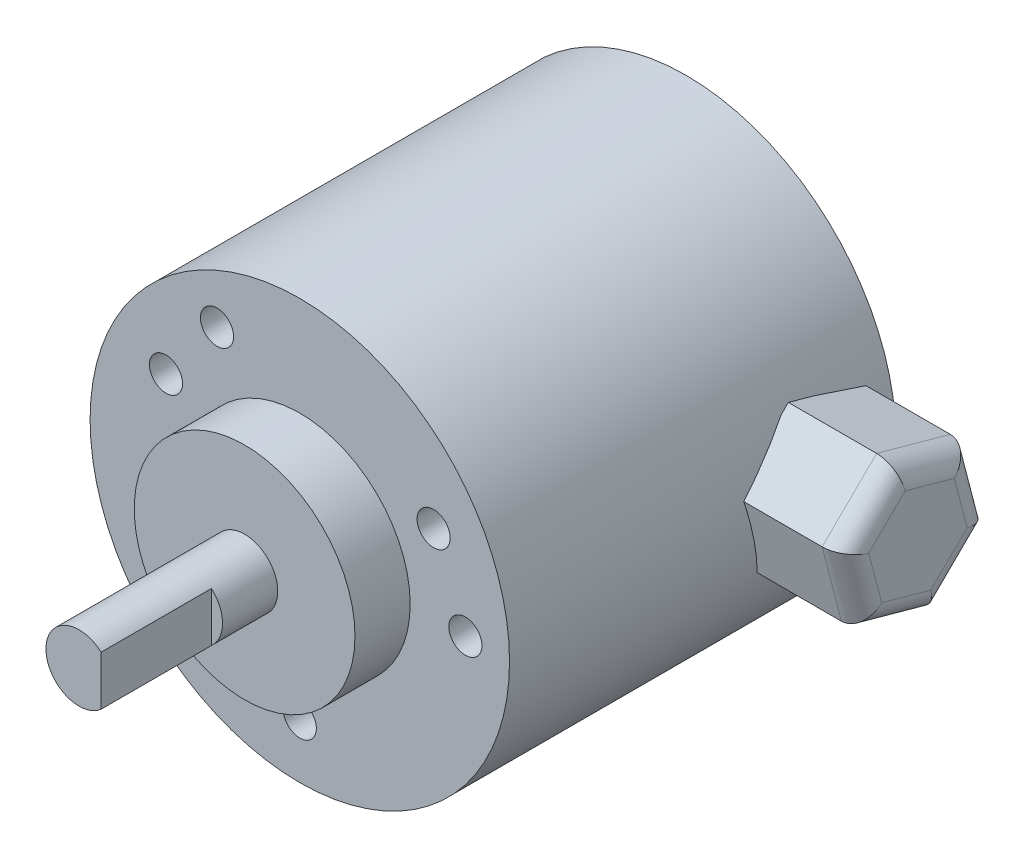
ISO-10303-21;
HEADER;
FILE_DESCRIPTION(('STEP AP214'),'2;1');
FILE_NAME('part.step','',(''),(''),'','','');
FILE_SCHEMA(('AUTOMOTIVE_DESIGN { 1 0 10303 214 1 1 1 1 }'));
ENDSEC;
DATA;
#1=APPLICATION_CONTEXT('core data for automotive mechanical design processes');
#2=APPLICATION_PROTOCOL_DEFINITION('international standard','automotive_design',2000,#1);
#3=PRODUCT_CONTEXT('',#1,'mechanical');
#4=PRODUCT('Part','Part','',(#3));
#5=PRODUCT_RELATED_PRODUCT_CATEGORY('part','',(#4));
#6=PRODUCT_DEFINITION_FORMATION('','',#4);
#7=PRODUCT_DEFINITION_CONTEXT('part definition',#1,'design');
#8=PRODUCT_DEFINITION('design','',#6,#7);
#9=PRODUCT_DEFINITION_SHAPE('','',#8);
#10=(LENGTH_UNIT() NAMED_UNIT(*) SI_UNIT(.MILLI.,.METRE.));
#11=(NAMED_UNIT(*) PLANE_ANGLE_UNIT() SI_UNIT($,.RADIAN.));
#12=(NAMED_UNIT(*) SI_UNIT($,.STERADIAN.) SOLID_ANGLE_UNIT());
#13=UNCERTAINTY_MEASURE_WITH_UNIT(LENGTH_MEASURE(1.E-05),#10,'distance_accuracy_value','');
#14=(GEOMETRIC_REPRESENTATION_CONTEXT(3) GLOBAL_UNCERTAINTY_ASSIGNED_CONTEXT((#13)) GLOBAL_UNIT_ASSIGNED_CONTEXT((#10,
#11,#12)) REPRESENTATION_CONTEXT('',''));
#15=CARTESIAN_POINT('',(0.,0.,0.));
#16=DIRECTION('',(0.,0.,1.));
#17=DIRECTION('',(1.,0.,0.));
#18=AXIS2_PLACEMENT_3D('',#15,#16,#17);
#19=CARTESIAN_POINT('',(18.,-1.84447824193407,0.321834082996154));
#20=DIRECTION('',(0.,0.251395330992635,-0.967884490812361));
#21=DIRECTION('',(0.,0.967884490812361,0.251395330992635));
#22=AXIS2_PLACEMENT_3D('',#19,#20,#21);
#23=PLANE('',#22);
#24=DIRECTION('',(1.,0.,0.));
#25=VECTOR('',#24,1.);
#26=CARTESIAN_POINT('',(18.,4.8612222138457,2.06355202725551));
#27=LINE('',#26,#25);
#28=CARTESIAN_POINT('',(18.,4.8612222138457,2.06355202725551));
#29=VERTEX_POINT('',#28);
#30=CARTESIAN_POINT('',(26.,4.8612222138457,2.06355202725551));
#31=VERTEX_POINT('',#30);
#32=EDGE_CURVE('E116',#29,#31,#27,.T.);
#33=ORIENTED_EDGE('',*,*,#32,.T.);
#34=DIRECTION('',(0.,0.967884490812361,0.251395330992635));
#35=VECTOR('',#34,1.);
#36=CARTESIAN_POINT('',(26.,-1.84447824193407,0.321834082996154));
#37=LINE('',#36,#35);
#38=CARTESIAN_POINT('',(26.,-1.84447824193407,0.321834082996154));
#39=VERTEX_POINT('',#38);
#40=EDGE_CURVE('E175',#31,#39,#37,.F.);
#41=ORIENTED_EDGE('',*,*,#40,.T.);
#42=DIRECTION('',(1.,0.,0.));
#43=VECTOR('',#42,1.);
#44=CARTESIAN_POINT('',(18.,-1.84447824193407,0.321834082996154));
#45=LINE('',#44,#43);
#46=CARTESIAN_POINT('',(18.,-1.84447824193407,0.321834082996154));
#47=VERTEX_POINT('',#46);
#48=EDGE_CURVE('E140',#47,#39,#45,.T.);
#49=ORIENTED_EDGE('',*,*,#48,.F.);
#50=DIRECTION('',(0.,0.967884490812361,0.251395330992635));
#51=VECTOR('',#50,1.);
#52=CARTESIAN_POINT('',(18.,-1.84447824193407,0.321834082996154));
#53=LINE('',#52,#51);
#54=EDGE_CURVE('E133',#47,#29,#53,.T.);
#55=ORIENTED_EDGE('',*,*,#54,.T.);
#56=EDGE_LOOP('',(#33,#41,#49,#55));
#57=FACE_BOUND('',#56,.T.);
#58=ADVANCED_FACE('F44',(#57),#23,.T.);
#59=CARTESIAN_POINT('',(18.,-6.70570045577977,5.25828205574064));
#60=DIRECTION('',(0.,-0.712514891476153,-0.7016569884386));
#61=DIRECTION('',(0.,0.7016569884386,-0.712514891476153));
#62=AXIS2_PLACEMENT_3D('',#59,#60,#61);
#63=PLANE('',#62);
#64=ORIENTED_EDGE('',*,*,#48,.T.);
#65=DIRECTION('',(0.,0.7016569884386,-0.712514891476153));
#66=VECTOR('',#65,1.);
#67=CARTESIAN_POINT('',(26.,-6.70570045577977,5.25828205574064));
#68=LINE('',#67,#66);
#69=CARTESIAN_POINT('',(26.,-6.70570045577977,5.25828205574064));
#70=VERTEX_POINT('',#69);
#71=EDGE_CURVE('E177',#39,#70,#68,.F.);
#72=ORIENTED_EDGE('',*,*,#71,.T.);
#73=DIRECTION('',(1.,0.,0.));
#74=VECTOR('',#73,1.);
#75=CARTESIAN_POINT('',(18.,-6.70570045577977,5.25828205574064));
#76=LINE('',#75,#74);
#77=CARTESIAN_POINT('',(18.,-6.70570045577977,5.25828205574064));
#78=VERTEX_POINT('',#77);
#79=EDGE_CURVE('E155',#78,#70,#76,.T.);
#80=ORIENTED_EDGE('',*,*,#79,.F.);
#81=DIRECTION('',(0.,0.7016569884386,-0.712514891476153));
#82=VECTOR('',#81,1.);
#83=CARTESIAN_POINT('',(18.,-6.70570045577977,5.25828205574064));
#84=LINE('',#83,#82);
#85=EDGE_CURVE('E126',#78,#47,#84,.T.);
#86=ORIENTED_EDGE('',*,*,#85,.T.);
#87=EDGE_LOOP('',(#64,#72,#80,#86));
#88=FACE_BOUND('',#87,.T.);
#89=ADVANCED_FACE('F215',(#88),#63,.T.);
#90=CARTESIAN_POINT('',(18.,-4.86122221384569,11.9364479727445));
#91=DIRECTION('',(0.,-0.963910222468789,0.266227502373761));
#92=DIRECTION('',(0.,-0.266227502373761,-0.963910222468788));
#93=AXIS2_PLACEMENT_3D('',#90,#91,#92);
#94=PLANE('',#93);
#95=ORIENTED_EDGE('',*,*,#79,.T.);
#96=DIRECTION('',(0.,-0.266227502373761,-0.963910222468788));
#97=VECTOR('',#96,1.);
#98=CARTESIAN_POINT('',(26.,-4.86122221384569,11.9364479727445));
#99=LINE('',#98,#97);
#100=CARTESIAN_POINT('',(26.,-4.86122221384569,11.9364479727445));
#101=VERTEX_POINT('',#100);
#102=EDGE_CURVE('E179',#70,#101,#99,.F.);
#103=ORIENTED_EDGE('',*,*,#102,.T.);
#104=DIRECTION('',(1.,0.,0.));
#105=VECTOR('',#104,1.);
#106=CARTESIAN_POINT('',(18.,-4.86122221384569,11.9364479727445));
#107=LINE('',#106,#105);
#108=CARTESIAN_POINT('',(18.,-4.86122221384569,11.9364479727445));
#109=VERTEX_POINT('',#108);
#110=EDGE_CURVE('E158',#109,#101,#107,.T.);
#111=ORIENTED_EDGE('',*,*,#110,.F.);
#112=DIRECTION('',(0.,-0.266227502373761,-0.963910222468788));
#113=VECTOR('',#112,1.);
#114=CARTESIAN_POINT('',(18.,-4.86122221384569,11.9364479727445));
#115=LINE('',#114,#113);
#116=EDGE_CURVE('E149',#109,#78,#115,.T.);
#117=ORIENTED_EDGE('',*,*,#116,.T.);
#118=EDGE_LOOP('',(#95,#103,#111,#117));
#119=FACE_BOUND('',#118,.T.);
#120=ADVANCED_FACE('F227',(#119),#94,.T.);
#121=CARTESIAN_POINT('',(18.,1.84447824193407,13.6781659170038));
#122=DIRECTION('',(0.,-0.251395330992636,0.967884490812361));
#123=DIRECTION('',(0.,-0.967884490812361,-0.251395330992636));
#124=AXIS2_PLACEMENT_3D('',#121,#122,#123);
#125=PLANE('',#124);
#126=ORIENTED_EDGE('',*,*,#110,.T.);
#127=DIRECTION('',(0.,-0.967884490812361,-0.251395330992636));
#128=VECTOR('',#127,1.);
#129=CARTESIAN_POINT('',(26.,1.84447824193407,13.6781659170038));
#130=LINE('',#129,#128);
#131=CARTESIAN_POINT('',(26.,1.84447824193407,13.6781659170038));
#132=VERTEX_POINT('',#131);
#133=EDGE_CURVE('E68',#101,#132,#130,.F.);
#134=ORIENTED_EDGE('',*,*,#133,.T.);
#135=DIRECTION('',(1.,0.,0.));
#136=VECTOR('',#135,1.);
#137=CARTESIAN_POINT('',(18.,1.84447824193407,13.6781659170038));
#138=LINE('',#137,#136);
#139=CARTESIAN_POINT('',(18.,1.84447824193407,13.6781659170038));
#140=VERTEX_POINT('',#139);
#141=EDGE_CURVE('E160',#140,#132,#138,.T.);
#142=ORIENTED_EDGE('',*,*,#141,.F.);
#143=DIRECTION('',(0.,-0.967884490812361,-0.251395330992636));
#144=VECTOR('',#143,1.);
#145=CARTESIAN_POINT('',(18.,1.84447824193407,13.6781659170038));
#146=LINE('',#145,#144);
#147=EDGE_CURVE('E146',#140,#109,#146,.T.);
#148=ORIENTED_EDGE('',*,*,#147,.T.);
#149=EDGE_LOOP('',(#126,#134,#142,#148));
#150=FACE_BOUND('',#149,.T.);
#151=ADVANCED_FACE('F218',(#150),#125,.T.);
#152=CARTESIAN_POINT('',(18.,6.70570045577977,8.74171794425936));
#153=DIRECTION('',(0.,0.712514891476153,0.7016569884386));
#154=DIRECTION('',(0.,-0.7016569884386,0.712514891476153));
#155=AXIS2_PLACEMENT_3D('',#152,#153,#154);
#156=PLANE('',#155);
#157=ORIENTED_EDGE('',*,*,#141,.T.);
#158=DIRECTION('',(0.,-0.7016569884386,0.712514891476153));
#159=VECTOR('',#158,1.);
#160=CARTESIAN_POINT('',(26.,6.70570045577977,8.74171794425936));
#161=LINE('',#160,#159);
#162=CARTESIAN_POINT('',(26.,6.70570045577977,8.74171794425936));
#163=VERTEX_POINT('',#162);
#164=EDGE_CURVE('E53',#132,#163,#161,.F.);
#165=ORIENTED_EDGE('',*,*,#164,.T.);
#166=DIRECTION('',(1.,0.,0.));
#167=VECTOR('',#166,1.);
#168=CARTESIAN_POINT('',(18.,6.70570045577977,8.74171794425936));
#169=LINE('',#168,#167);
#170=CARTESIAN_POINT('',(18.,6.70570045577977,8.74171794425936));
#171=VERTEX_POINT('',#170);
#172=EDGE_CURVE('E125',#171,#163,#169,.T.);
#173=ORIENTED_EDGE('',*,*,#172,.F.);
#174=DIRECTION('',(0.,-0.7016569884386,0.712514891476153));
#175=VECTOR('',#174,1.);
#176=CARTESIAN_POINT('',(18.,6.70570045577977,8.74171794425936));
#177=LINE('',#176,#175);
#178=EDGE_CURVE('E137',#171,#140,#177,.T.);
#179=ORIENTED_EDGE('',*,*,#178,.T.);
#180=EDGE_LOOP('',(#157,#165,#173,#179));
#181=FACE_BOUND('',#180,.T.);
#182=ADVANCED_FACE('F219',(#181),#156,.T.);
#183=CARTESIAN_POINT('',(18.,4.8612222138457,2.06355202725551));
#184=DIRECTION('',(0.,0.963910222468788,-0.266227502373761));
#185=DIRECTION('',(0.,0.266227502373761,0.963910222468788));
#186=AXIS2_PLACEMENT_3D('',#183,#184,#185);
#187=PLANE('',#186);
#188=ORIENTED_EDGE('',*,*,#172,.T.);
#189=DIRECTION('',(0.,0.266227502373761,0.963910222468788));
#190=VECTOR('',#189,1.);
#191=CARTESIAN_POINT('',(26.,4.8612222138457,2.06355202725551));
#192=LINE('',#191,#190);
#193=EDGE_CURVE('E12',#163,#31,#192,.F.);
#194=ORIENTED_EDGE('',*,*,#193,.T.);
#195=ORIENTED_EDGE('',*,*,#32,.F.);
#196=DIRECTION('',(0.,0.266227502373761,0.963910222468788));
#197=VECTOR('',#196,1.);
#198=CARTESIAN_POINT('',(18.,4.8612222138457,2.06355202725551));
#199=LINE('',#198,#197);
#200=EDGE_CURVE('E119',#29,#171,#199,.T.);
#201=ORIENTED_EDGE('',*,*,#200,.T.);
#202=EDGE_LOOP('',(#188,#194,#195,#201));
#203=FACE_BOUND('',#202,.T.);
#204=ADVANCED_FACE('F118',(#203),#187,.T.);
#205=CARTESIAN_POINT('',(18.,0.,0.));
#206=DIRECTION('',(1.,0.,0.));
#207=DIRECTION('',(0.,0.,-1.));
#208=AXIS2_PLACEMENT_3D('',#205,#206,#207);
#209=PLANE('',#208);
#210=ORIENTED_EDGE('',*,*,#54,.F.);
#211=ORIENTED_EDGE('',*,*,#85,.F.);
#212=ORIENTED_EDGE('',*,*,#116,.F.);
#213=ORIENTED_EDGE('',*,*,#147,.F.);
#214=ORIENTED_EDGE('',*,*,#178,.F.);
#215=ORIENTED_EDGE('',*,*,#200,.F.);
#216=EDGE_LOOP('',(#210,#211,#212,#213,#214,#215));
#217=FACE_BOUND('',#216,.T.);
#218=ADVANCED_FACE('F131',(#217),#209,.F.);
#219=CARTESIAN_POINT('',(28.,0.,0.));
#220=DIRECTION('',(1.,0.,0.));
#221=DIRECTION('',(0.,0.,-1.));
#222=AXIS2_PLACEMENT_3D('',#219,#220,#221);
#223=PLANE('',#222);
#224=DIRECTION('',(0.,0.7016569884386,-0.712514891476153));
#225=VECTOR('',#224,1.);
#226=CARTESIAN_POINT('',(28.,0.649527804891081,0.639629752218679));
#227=LINE('',#226,#225);
#228=CARTESIAN_POINT('',(28.,-4.47046697051984,5.83885470382709));
#229=VERTEX_POINT('',#228);
#230=CARTESIAN_POINT('',(28.,-1.22965216128938,2.5478893886641));
#231=VERTEX_POINT('',#230);
#232=EDGE_CURVE('E170',#229,#231,#227,.T.);
#233=ORIENTED_EDGE('',*,*,#232,.T.);
#234=DIRECTION('',(0.,0.967884490812361,0.251395330992635));
#235=VECTOR('',#234,1.);
#236=CARTESIAN_POINT('',(28.,-0.697670169542341,2.68606474963628));
#237=LINE('',#236,#235);
#238=CARTESIAN_POINT('',(28.,3.24081480923047,3.70903468483701));
#239=VERTEX_POINT('',#238);
#240=EDGE_CURVE('E172',#231,#239,#237,.T.);
#241=ORIENTED_EDGE('',*,*,#240,.T.);
#242=DIRECTION('',(0.,0.266227502373761,0.963910222468788));
#243=VECTOR('',#242,1.);
#244=CARTESIAN_POINT('',(28.,2.05930501259234,-0.568770428353848));
#245=LINE('',#244,#243);
#246=CARTESIAN_POINT('',(28.,4.47046697051984,8.16114529617291));
#247=VERTEX_POINT('',#246);
#248=EDGE_CURVE('E154',#239,#247,#245,.T.);
#249=ORIENTED_EDGE('',*,*,#248,.T.);
#250=DIRECTION('',(0.,-0.7016569884386,0.712514891476153));
#251=VECTOR('',#250,1.);
#252=CARTESIAN_POINT('',(28.,6.34964693670031,6.25288565972748));
#253=LINE('',#252,#251);
#254=CARTESIAN_POINT('',(28.,1.22965216128938,11.4521106113359));
#255=VERTEX_POINT('',#254);
#256=EDGE_CURVE('E164',#247,#255,#253,.T.);
#257=ORIENTED_EDGE('',*,*,#256,.T.);
#258=DIRECTION('',(0.,-0.967884490812361,-0.251395330992636));
#259=VECTOR('',#258,1.);
#260=CARTESIAN_POINT('',(28.,-2.70883281748343,10.4291406761352));
#261=LINE('',#260,#259);
#262=CARTESIAN_POINT('',(28.,-3.24081480923046,10.290965315163));
#263=VERTEX_POINT('',#262);
#264=EDGE_CURVE('E166',#255,#263,#261,.T.);
#265=ORIENTED_EDGE('',*,*,#264,.T.);
#266=DIRECTION('',(0.,-0.266227502373761,-0.963910222468788));
#267=VECTOR('',#266,1.);
#268=CARTESIAN_POINT('',(28.,-5.65197676715797,1.56104959063624));
#269=LINE('',#268,#267);
#270=EDGE_CURVE('E168',#263,#229,#269,.T.);
#271=ORIENTED_EDGE('',*,*,#270,.T.);
#272=EDGE_LOOP('',(#233,#241,#249,#257,#265,#271));
#273=FACE_BOUND('',#272,.T.);
#274=ADVANCED_FACE('F203',(#273),#223,.T.);
#275=CARTESIAN_POINT('',(26.,-2.70883281748343,10.4291406761352));
#276=DIRECTION('',(0.,-0.967884490812361,-0.251395330992636));
#277=DIRECTION('',(0.,0.251395330992636,-0.967884490812361));
#278=AXIS2_PLACEMENT_3D('',#275,#276,#277);
#279=CYLINDRICAL_SURFACE('',#278,2.);
#280=CARTESIAN_POINT('',(26.,1.22965216128938,11.4521106113359));
#281=DIRECTION('',(0.,-0.963910222468788,0.266227502373761));
#282=DIRECTION('',(0.,0.266227502373761,0.963910222468788));
#283=AXIS2_PLACEMENT_3D('',#280,#281,#282);
#284=ELLIPSE('',#283,2.3094010767585,2.);
#285=EDGE_CURVE('E143',#132,#255,#284,.F.);
#286=ORIENTED_EDGE('',*,*,#285,.F.);
#287=ORIENTED_EDGE('',*,*,#133,.F.);
#288=CARTESIAN_POINT('',(26.,-3.24081480923046,10.290965315163));
#289=DIRECTION('',(0.,-0.712514891476153,-0.7016569884386));
#290=DIRECTION('',(0.,-0.7016569884386,0.712514891476153));
#291=AXIS2_PLACEMENT_3D('',#288,#289,#290);
#292=ELLIPSE('',#291,2.3094010767585,2.);
#293=EDGE_CURVE('E48',#263,#101,#292,.T.);
#294=ORIENTED_EDGE('',*,*,#293,.F.);
#295=ORIENTED_EDGE('',*,*,#264,.F.);
#296=EDGE_LOOP('',(#286,#287,#294,#295));
#297=FACE_BOUND('',#296,.T.);
#298=ADVANCED_FACE('F46',(#297),#279,.T.);
#299=CARTESIAN_POINT('',(26.,-5.65197676715797,1.56104959063624));
#300=DIRECTION('',(0.,-0.266227502373761,-0.963910222468788));
#301=DIRECTION('',(0.,0.963910222468789,-0.266227502373761));
#302=AXIS2_PLACEMENT_3D('',#299,#300,#301);
#303=CYLINDRICAL_SURFACE('',#302,2.);
#304=ORIENTED_EDGE('',*,*,#293,.T.);
#305=ORIENTED_EDGE('',*,*,#102,.F.);
#306=CARTESIAN_POINT('',(26.,-4.47046697051984,5.83885470382709));
#307=DIRECTION('',(0.,0.251395330992635,-0.967884490812361));
#308=DIRECTION('',(0.,-0.967884490812361,-0.251395330992635));
#309=AXIS2_PLACEMENT_3D('',#306,#307,#308);
#310=ELLIPSE('',#309,2.3094010767585,2.);
#311=EDGE_CURVE('E190',#229,#70,#310,.T.);
#312=ORIENTED_EDGE('',*,*,#311,.F.);
#313=ORIENTED_EDGE('',*,*,#270,.F.);
#314=EDGE_LOOP('',(#304,#305,#312,#313));
#315=FACE_BOUND('',#314,.T.);
#316=ADVANCED_FACE('F245',(#315),#303,.T.);
#317=CARTESIAN_POINT('',(26.,6.34964693670031,6.25288565972748));
#318=DIRECTION('',(0.,-0.7016569884386,0.712514891476153));
#319=DIRECTION('',(0.,-0.712514891476153,-0.7016569884386));
#320=AXIS2_PLACEMENT_3D('',#317,#318,#319);
#321=CYLINDRICAL_SURFACE('',#320,2.);
#322=ORIENTED_EDGE('',*,*,#285,.T.);
#323=ORIENTED_EDGE('',*,*,#256,.F.);
#324=CARTESIAN_POINT('',(26.,4.47046697051984,8.1611452961729));
#325=DIRECTION('',(0.,-0.251395330992636,0.967884490812361));
#326=DIRECTION('',(0.,0.967884490812361,0.251395330992636));
#327=AXIS2_PLACEMENT_3D('',#324,#325,#326);
#328=ELLIPSE('',#327,2.3094010767585,2.);
#329=EDGE_CURVE('E187',#163,#247,#328,.F.);
#330=ORIENTED_EDGE('',*,*,#329,.F.);
#331=ORIENTED_EDGE('',*,*,#164,.F.);
#332=EDGE_LOOP('',(#322,#323,#330,#331));
#333=FACE_BOUND('',#332,.T.);
#334=ADVANCED_FACE('F196',(#333),#321,.T.);
#335=CARTESIAN_POINT('',(26.,0.649527804891081,0.639629752218679));
#336=DIRECTION('',(0.,0.7016569884386,-0.712514891476153));
#337=DIRECTION('',(0.,0.712514891476153,0.7016569884386));
#338=AXIS2_PLACEMENT_3D('',#335,#336,#337);
#339=CYLINDRICAL_SURFACE('',#338,2.);
#340=ORIENTED_EDGE('',*,*,#311,.T.);
#341=ORIENTED_EDGE('',*,*,#71,.F.);
#342=CARTESIAN_POINT('',(26.,-1.22965216128938,2.5478893886641));
#343=DIRECTION('',(0.,0.963910222468788,-0.266227502373761));
#344=DIRECTION('',(0.,-0.266227502373761,-0.963910222468789));
#345=AXIS2_PLACEMENT_3D('',#342,#343,#344);
#346=ELLIPSE('',#345,2.3094010767585,2.);
#347=EDGE_CURVE('E185',#231,#39,#346,.T.);
#348=ORIENTED_EDGE('',*,*,#347,.F.);
#349=ORIENTED_EDGE('',*,*,#232,.F.);
#350=EDGE_LOOP('',(#340,#341,#348,#349));
#351=FACE_BOUND('',#350,.T.);
#352=ADVANCED_FACE('F240',(#351),#339,.T.);
#353=CARTESIAN_POINT('',(26.,2.05930501259234,-0.568770428353848));
#354=DIRECTION('',(0.,0.266227502373761,0.963910222468788));
#355=DIRECTION('',(0.,-0.963910222468788,0.266227502373761));
#356=AXIS2_PLACEMENT_3D('',#353,#354,#355);
#357=CYLINDRICAL_SURFACE('',#356,2.);
#358=ORIENTED_EDGE('',*,*,#329,.T.);
#359=ORIENTED_EDGE('',*,*,#248,.F.);
#360=CARTESIAN_POINT('',(26.,3.24081480923046,3.70903468483701));
#361=DIRECTION('',(0.,0.712514891476153,0.7016569884386));
#362=DIRECTION('',(0.,-0.7016569884386,0.712514891476153));
#363=AXIS2_PLACEMENT_3D('',#360,#361,#362);
#364=ELLIPSE('',#363,2.3094010767585,2.);
#365=EDGE_CURVE('E183',#31,#239,#364,.F.);
#366=ORIENTED_EDGE('',*,*,#365,.F.);
#367=ORIENTED_EDGE('',*,*,#193,.F.);
#368=EDGE_LOOP('',(#358,#359,#366,#367));
#369=FACE_BOUND('',#368,.T.);
#370=ADVANCED_FACE('F209',(#369),#357,.T.);
#371=CARTESIAN_POINT('',(26.,-0.697670169542341,2.68606474963628));
#372=DIRECTION('',(0.,0.967884490812361,0.251395330992635));
#373=DIRECTION('',(0.,-0.251395330992635,0.967884490812361));
#374=AXIS2_PLACEMENT_3D('',#371,#372,#373);
#375=CYLINDRICAL_SURFACE('',#374,2.);
#376=ORIENTED_EDGE('',*,*,#347,.T.);
#377=ORIENTED_EDGE('',*,*,#40,.F.);
#378=ORIENTED_EDGE('',*,*,#365,.T.);
#379=ORIENTED_EDGE('',*,*,#240,.F.);
#380=EDGE_LOOP('',(#376,#377,#378,#379));
#381=FACE_BOUND('',#380,.T.);
#382=ADVANCED_FACE('F211',(#381),#375,.T.);
#383=CLOSED_SHELL('',(#58,#89,#120,#151,#182,#204,#218,#274,#298,#316,#334,#352,#370,#382));
#384=MANIFOLD_SOLID_BREP('B2',#383);
#385=CARTESIAN_POINT('',(0.,0.,40.));
#386=DIRECTION('',(0.,0.,-1.));
#387=DIRECTION('',(-1.,0.,0.));
#388=AXIS2_PLACEMENT_3D('',#385,#386,#387);
#389=CYLINDRICAL_SURFACE('',#388,19.);
#390=CARTESIAN_POINT('',(0.,0.,0.));
#391=DIRECTION('',(0.,0.,1.));
#392=DIRECTION('',(1.,0.,0.));
#393=AXIS2_PLACEMENT_3D('',#390,#391,#392);
#394=CIRCLE('',#393,19.);
#395=CARTESIAN_POINT('',(19.,0.,0.));
#396=VERTEX_POINT('',#395);
#397=EDGE_CURVE('E42',#396,#396,#394,.T.);
#398=ORIENTED_EDGE('',*,*,#397,.T.);
#399=EDGE_LOOP('',(#398));
#400=FACE_BOUND('',#399,.T.);
#401=CARTESIAN_POINT('',(0.,0.,35.));
#402=DIRECTION('',(0.,0.,1.));
#403=DIRECTION('',(1.,0.,0.));
#404=AXIS2_PLACEMENT_3D('',#401,#402,#403);
#405=CIRCLE('',#404,19.);
#406=CARTESIAN_POINT('',(19.,0.,35.));
#407=VERTEX_POINT('',#406);
#408=EDGE_CURVE('E346',#407,#407,#405,.T.);
#409=ORIENTED_EDGE('',*,*,#408,.F.);
#410=EDGE_LOOP('',(#409));
#411=FACE_BOUND('',#410,.T.);
#412=ADVANCED_FACE('F339',(#400,#411),#389,.T.);
#413=CARTESIAN_POINT('',(0.,0.,0.));
#414=DIRECTION('',(0.,0.,1.));
#415=DIRECTION('',(1.,0.,0.));
#416=AXIS2_PLACEMENT_3D('',#413,#414,#415);
#417=PLANE('',#416);
#418=ORIENTED_EDGE('',*,*,#397,.F.);
#419=EDGE_LOOP('',(#418));
#420=FACE_BOUND('',#419,.T.);
#421=ADVANCED_FACE('F431',(#420),#417,.F.);
#422=CARTESIAN_POINT('',(0.,0.,35.));
#423=DIRECTION('',(0.,0.,1.));
#424=DIRECTION('',(1.,0.,0.));
#425=AXIS2_PLACEMENT_3D('',#422,#423,#424);
#426=PLANE('',#425);
#427=CARTESIAN_POINT('',(0.,-14.,35.));
#428=DIRECTION('',(0.,0.,1.));
#429=DIRECTION('',(1.,0.,0.));
#430=AXIS2_PLACEMENT_3D('',#427,#428,#429);
#431=CIRCLE('',#430,1.5);
#432=CARTESIAN_POINT('',(1.49999999999995,-14.,35.));
#433=VERTEX_POINT('',#432);
#434=EDGE_CURVE('E379',#433,#433,#431,.T.);
#435=ORIENTED_EDGE('',*,*,#434,.F.);
#436=EDGE_LOOP('',(#435));
#437=FACE_BOUND('',#436,.T.);
#438=CARTESIAN_POINT('',(-12.1243556529822,6.99999999999992,35.));
#439=DIRECTION('',(0.,0.,1.));
#440=DIRECTION('',(1.,0.,0.));
#441=AXIS2_PLACEMENT_3D('',#438,#439,#440);
#442=CIRCLE('',#441,1.5);
#443=CARTESIAN_POINT('',(-10.6243556529822,6.99999999999992,35.));
#444=VERTEX_POINT('',#443);
#445=EDGE_CURVE('E389',#444,#444,#442,.T.);
#446=ORIENTED_EDGE('',*,*,#445,.F.);
#447=EDGE_LOOP('',(#446));
#448=FACE_BOUND('',#447,.T.);
#449=CARTESIAN_POINT('',(12.1243556529821,7.00000000000002,35.));
#450=DIRECTION('',(0.,0.,1.));
#451=DIRECTION('',(1.,0.,0.));
#452=AXIS2_PLACEMENT_3D('',#449,#450,#451);
#453=CIRCLE('',#452,1.5);
#454=CARTESIAN_POINT('',(13.6243556529821,7.00000000000002,35.));
#455=VERTEX_POINT('',#454);
#456=EDGE_CURVE('E394',#455,#455,#453,.T.);
#457=ORIENTED_EDGE('',*,*,#456,.F.);
#458=EDGE_LOOP('',(#457));
#459=FACE_BOUND('',#458,.T.);
#460=CARTESIAN_POINT('',(-7.49999999999988,12.9903810567667,35.));
#461=DIRECTION('',(0.,0.,1.));
#462=DIRECTION('',(1.,0.,0.));
#463=AXIS2_PLACEMENT_3D('',#460,#461,#462);
#464=CIRCLE('',#463,1.5);
#465=CARTESIAN_POINT('',(-5.99999999999988,12.9903810567667,35.));
#466=VERTEX_POINT('',#465);
#467=EDGE_CURVE('E400',#466,#466,#464,.T.);
#468=ORIENTED_EDGE('',*,*,#467,.F.);
#469=EDGE_LOOP('',(#468));
#470=FACE_BOUND('',#469,.T.);
#471=CARTESIAN_POINT('',(-7.50000000000006,-12.9903810567665,35.));
#472=DIRECTION('',(0.,0.,1.));
#473=DIRECTION('',(1.,0.,0.));
#474=AXIS2_PLACEMENT_3D('',#471,#472,#473);
#475=CIRCLE('',#474,1.5);
#476=CARTESIAN_POINT('',(-6.00000000000006,-12.9903810567665,35.));
#477=VERTEX_POINT('',#476);
#478=EDGE_CURVE('E406',#477,#477,#475,.T.);
#479=ORIENTED_EDGE('',*,*,#478,.F.);
#480=EDGE_LOOP('',(#479));
#481=FACE_BOUND('',#480,.T.);
#482=CARTESIAN_POINT('',(15.,0.,35.));
#483=DIRECTION('',(0.,0.,1.));
#484=DIRECTION('',(1.,0.,0.));
#485=AXIS2_PLACEMENT_3D('',#482,#483,#484);
#486=CIRCLE('',#485,1.5);
#487=CARTESIAN_POINT('',(16.5,0.,35.));
#488=VERTEX_POINT('',#487);
#489=EDGE_CURVE('E412',#488,#488,#486,.T.);
#490=ORIENTED_EDGE('',*,*,#489,.F.);
#491=EDGE_LOOP('',(#490));
#492=FACE_BOUND('',#491,.T.);
#493=CARTESIAN_POINT('',(0.,0.,35.));
#494=DIRECTION('',(0.,0.,1.));
#495=DIRECTION('',(1.,0.,0.));
#496=AXIS2_PLACEMENT_3D('',#493,#494,#495);
#497=CIRCLE('',#496,10.);
#498=CARTESIAN_POINT('',(10.,0.,35.));
#499=VERTEX_POINT('',#498);
#500=EDGE_CURVE('E421',#499,#499,#497,.T.);
#501=ORIENTED_EDGE('',*,*,#500,.F.);
#502=EDGE_LOOP('',(#501));
#503=FACE_BOUND('',#502,.T.);
#504=ORIENTED_EDGE('',*,*,#408,.T.);
#505=EDGE_LOOP('',(#504));
#506=FACE_BOUND('',#505,.T.);
#507=ADVANCED_FACE('F428',(#437,#448,#459,#470,#481,#492,#503,#506),#426,.T.);
#508=CARTESIAN_POINT('',(0.,0.,35.));
#509=DIRECTION('',(0.,0.,1.));
#510=DIRECTION('',(1.,0.,0.));
#511=AXIS2_PLACEMENT_3D('',#508,#509,#510);
#512=CYLINDRICAL_SURFACE('',#511,10.);
#513=ORIENTED_EDGE('',*,*,#500,.T.);
#514=EDGE_LOOP('',(#513));
#515=FACE_BOUND('',#514,.T.);
#516=CARTESIAN_POINT('',(0.,0.,40.));
#517=DIRECTION('',(0.,0.,1.));
#518=DIRECTION('',(1.,0.,0.));
#519=AXIS2_PLACEMENT_3D('',#516,#517,#518);
#520=CIRCLE('',#519,10.);
#521=CARTESIAN_POINT('',(10.,0.,40.));
#522=VERTEX_POINT('',#521);
#523=EDGE_CURVE('E418',#522,#522,#520,.T.);
#524=ORIENTED_EDGE('',*,*,#523,.F.);
#525=EDGE_LOOP('',(#524));
#526=FACE_BOUND('',#525,.T.);
#527=ADVANCED_FACE('F441',(#515,#526),#512,.T.);
#528=CARTESIAN_POINT('',(0.,0.,40.));
#529=DIRECTION('',(0.,0.,1.));
#530=DIRECTION('',(1.,0.,0.));
#531=AXIS2_PLACEMENT_3D('',#528,#529,#530);
#532=PLANE('',#531);
#533=CARTESIAN_POINT('',(0.,0.,40.));
#534=DIRECTION('',(0.,0.,1.));
#535=DIRECTION('',(1.,0.,0.));
#536=AXIS2_PLACEMENT_3D('',#533,#534,#535);
#537=CIRCLE('',#536,3.);
#538=CARTESIAN_POINT('',(3.,0.,40.));
#539=VERTEX_POINT('',#538);
#540=EDGE_CURVE('E376',#539,#539,#537,.T.);
#541=ORIENTED_EDGE('',*,*,#540,.F.);
#542=EDGE_LOOP('',(#541));
#543=FACE_BOUND('',#542,.T.);
#544=ORIENTED_EDGE('',*,*,#523,.T.);
#545=EDGE_LOOP('',(#544));
#546=FACE_BOUND('',#545,.T.);
#547=ADVANCED_FACE('F445',(#543,#546),#532,.T.);
#548=CARTESIAN_POINT('',(15.,0.,28.4));
#549=DIRECTION('',(0.,0.,1.));
#550=DIRECTION('',(1.,0.,0.));
#551=AXIS2_PLACEMENT_3D('',#548,#549,#550);
#552=CYLINDRICAL_SURFACE('',#551,1.5);
#553=CARTESIAN_POINT('',(15.,0.,28.4));
#554=DIRECTION('',(0.,0.,1.));
#555=DIRECTION('',(1.,0.,0.));
#556=AXIS2_PLACEMENT_3D('',#553,#554,#555);
#557=CIRCLE('',#556,1.5);
#558=CARTESIAN_POINT('',(16.5,0.,28.4));
#559=VERTEX_POINT('',#558);
#560=EDGE_CURVE('E415',#559,#559,#557,.T.);
#561=ORIENTED_EDGE('',*,*,#560,.F.);
#562=EDGE_LOOP('',(#561));
#563=FACE_BOUND('',#562,.T.);
#564=ORIENTED_EDGE('',*,*,#489,.T.);
#565=EDGE_LOOP('',(#564));
#566=FACE_BOUND('',#565,.T.);
#567=ADVANCED_FACE('F447',(#563,#566),#552,.F.);
#568=CARTESIAN_POINT('',(15.,0.,28.4));
#569=DIRECTION('',(0.,0.,1.));
#570=DIRECTION('',(1.,0.,0.));
#571=AXIS2_PLACEMENT_3D('',#568,#569,#570);
#572=PLANE('',#571);
#573=ORIENTED_EDGE('',*,*,#560,.T.);
#574=EDGE_LOOP('',(#573));
#575=FACE_BOUND('',#574,.T.);
#576=ADVANCED_FACE('F455',(#575),#572,.T.);
#577=CARTESIAN_POINT('',(-7.50000000000006,-12.9903810567665,28.4));
#578=DIRECTION('',(0.,0.,1.));
#579=DIRECTION('',(1.,0.,0.));
#580=AXIS2_PLACEMENT_3D('',#577,#578,#579);
#581=CYLINDRICAL_SURFACE('',#580,1.5);
#582=CARTESIAN_POINT('',(-7.50000000000006,-12.9903810567665,28.4));
#583=DIRECTION('',(0.,0.,1.));
#584=DIRECTION('',(1.,0.,0.));
#585=AXIS2_PLACEMENT_3D('',#582,#583,#584);
#586=CIRCLE('',#585,1.5);
#587=CARTESIAN_POINT('',(-6.00000000000006,-12.9903810567665,28.4));
#588=VERTEX_POINT('',#587);
#589=EDGE_CURVE('E409',#588,#588,#586,.T.);
#590=ORIENTED_EDGE('',*,*,#589,.F.);
#591=EDGE_LOOP('',(#590));
#592=FACE_BOUND('',#591,.T.);
#593=ORIENTED_EDGE('',*,*,#478,.T.);
#594=EDGE_LOOP('',(#593));
#595=FACE_BOUND('',#594,.T.);
#596=ADVANCED_FACE('F459',(#592,#595),#581,.F.);
#597=CARTESIAN_POINT('',(-7.50000000000006,-12.9903810567665,28.4));
#598=DIRECTION('',(0.,0.,1.));
#599=DIRECTION('',(1.,0.,0.));
#600=AXIS2_PLACEMENT_3D('',#597,#598,#599);
#601=PLANE('',#600);
#602=ORIENTED_EDGE('',*,*,#589,.T.);
#603=EDGE_LOOP('',(#602));
#604=FACE_BOUND('',#603,.T.);
#605=ADVANCED_FACE('F463',(#604),#601,.T.);
#606=CARTESIAN_POINT('',(-7.49999999999988,12.9903810567667,28.4));
#607=DIRECTION('',(0.,0.,1.));
#608=DIRECTION('',(1.,0.,0.));
#609=AXIS2_PLACEMENT_3D('',#606,#607,#608);
#610=CYLINDRICAL_SURFACE('',#609,1.5);
#611=CARTESIAN_POINT('',(-7.49999999999988,12.9903810567667,28.4));
#612=DIRECTION('',(0.,0.,1.));
#613=DIRECTION('',(1.,0.,0.));
#614=AXIS2_PLACEMENT_3D('',#611,#612,#613);
#615=CIRCLE('',#614,1.5);
#616=CARTESIAN_POINT('',(-5.99999999999988,12.9903810567667,28.4));
#617=VERTEX_POINT('',#616);
#618=EDGE_CURVE('E403',#617,#617,#615,.T.);
#619=ORIENTED_EDGE('',*,*,#618,.F.);
#620=EDGE_LOOP('',(#619));
#621=FACE_BOUND('',#620,.T.);
#622=ORIENTED_EDGE('',*,*,#467,.T.);
#623=EDGE_LOOP('',(#622));
#624=FACE_BOUND('',#623,.T.);
#625=ADVANCED_FACE('F467',(#621,#624),#610,.F.);
#626=CARTESIAN_POINT('',(-7.49999999999988,12.9903810567667,28.4));
#627=DIRECTION('',(0.,0.,1.));
#628=DIRECTION('',(1.,0.,0.));
#629=AXIS2_PLACEMENT_3D('',#626,#627,#628);
#630=PLANE('',#629);
#631=ORIENTED_EDGE('',*,*,#618,.T.);
#632=EDGE_LOOP('',(#631));
#633=FACE_BOUND('',#632,.T.);
#634=ADVANCED_FACE('F471',(#633),#630,.T.);
#635=CARTESIAN_POINT('',(12.1243556529821,7.00000000000002,28.4));
#636=DIRECTION('',(0.,0.,1.));
#637=DIRECTION('',(1.,0.,0.));
#638=AXIS2_PLACEMENT_3D('',#635,#636,#637);
#639=CYLINDRICAL_SURFACE('',#638,1.5);
#640=CARTESIAN_POINT('',(12.1243556529821,7.00000000000002,28.4));
#641=DIRECTION('',(0.,0.,1.));
#642=DIRECTION('',(1.,0.,0.));
#643=AXIS2_PLACEMENT_3D('',#640,#641,#642);
#644=CIRCLE('',#643,1.5);
#645=CARTESIAN_POINT('',(13.6243556529821,7.00000000000002,28.4));
#646=VERTEX_POINT('',#645);
#647=EDGE_CURVE('E397',#646,#646,#644,.T.);
#648=ORIENTED_EDGE('',*,*,#647,.F.);
#649=EDGE_LOOP('',(#648));
#650=FACE_BOUND('',#649,.T.);
#651=ORIENTED_EDGE('',*,*,#456,.T.);
#652=EDGE_LOOP('',(#651));
#653=FACE_BOUND('',#652,.T.);
#654=ADVANCED_FACE('F475',(#650,#653),#639,.F.);
#655=CARTESIAN_POINT('',(12.1243556529821,7.00000000000002,28.4));
#656=DIRECTION('',(0.,0.,1.));
#657=DIRECTION('',(1.,0.,0.));
#658=AXIS2_PLACEMENT_3D('',#655,#656,#657);
#659=PLANE('',#658);
#660=ORIENTED_EDGE('',*,*,#647,.T.);
#661=EDGE_LOOP('',(#660));
#662=FACE_BOUND('',#661,.T.);
#663=ADVANCED_FACE('F479',(#662),#659,.T.);
#664=CARTESIAN_POINT('',(-12.1243556529822,6.99999999999992,28.4));
#665=DIRECTION('',(0.,0.,1.));
#666=DIRECTION('',(1.,0.,0.));
#667=AXIS2_PLACEMENT_3D('',#664,#665,#666);
#668=CYLINDRICAL_SURFACE('',#667,1.5);
#669=CARTESIAN_POINT('',(-12.1243556529822,6.99999999999992,28.4));
#670=DIRECTION('',(0.,0.,1.));
#671=DIRECTION('',(1.,0.,0.));
#672=AXIS2_PLACEMENT_3D('',#669,#670,#671);
#673=CIRCLE('',#672,1.5);
#674=CARTESIAN_POINT('',(-10.6243556529822,6.99999999999992,28.4));
#675=VERTEX_POINT('',#674);
#676=EDGE_CURVE('E391',#675,#675,#673,.T.);
#677=ORIENTED_EDGE('',*,*,#676,.F.);
#678=EDGE_LOOP('',(#677));
#679=FACE_BOUND('',#678,.T.);
#680=ORIENTED_EDGE('',*,*,#445,.T.);
#681=EDGE_LOOP('',(#680));
#682=FACE_BOUND('',#681,.T.);
#683=ADVANCED_FACE('F483',(#679,#682),#668,.F.);
#684=CARTESIAN_POINT('',(-12.1243556529822,6.99999999999992,28.4));
#685=DIRECTION('',(0.,0.,1.));
#686=DIRECTION('',(1.,0.,0.));
#687=AXIS2_PLACEMENT_3D('',#684,#685,#686);
#688=PLANE('',#687);
#689=ORIENTED_EDGE('',*,*,#676,.T.);
#690=EDGE_LOOP('',(#689));
#691=FACE_BOUND('',#690,.T.);
#692=ADVANCED_FACE('F487',(#691),#688,.T.);
#693=CARTESIAN_POINT('',(0.,-14.,28.4));
#694=DIRECTION('',(0.,0.,1.));
#695=DIRECTION('',(1.,0.,0.));
#696=AXIS2_PLACEMENT_3D('',#693,#694,#695);
#697=CYLINDRICAL_SURFACE('',#696,1.5);
#698=CARTESIAN_POINT('',(0.,-14.,28.4));
#699=DIRECTION('',(0.,0.,1.));
#700=DIRECTION('',(1.,0.,0.));
#701=AXIS2_PLACEMENT_3D('',#698,#699,#700);
#702=CIRCLE('',#701,1.5);
#703=CARTESIAN_POINT('',(1.49999999999995,-14.,28.4));
#704=VERTEX_POINT('',#703);
#705=EDGE_CURVE('E382',#704,#704,#702,.T.);
#706=ORIENTED_EDGE('',*,*,#705,.F.);
#707=EDGE_LOOP('',(#706));
#708=FACE_BOUND('',#707,.T.);
#709=ORIENTED_EDGE('',*,*,#434,.T.);
#710=EDGE_LOOP('',(#709));
#711=FACE_BOUND('',#710,.T.);
#712=ADVANCED_FACE('F491',(#708,#711),#697,.F.);
#713=CARTESIAN_POINT('',(0.,-14.,28.4));
#714=DIRECTION('',(0.,0.,1.));
#715=DIRECTION('',(1.,0.,0.));
#716=AXIS2_PLACEMENT_3D('',#713,#714,#715);
#717=PLANE('',#716);
#718=ORIENTED_EDGE('',*,*,#705,.T.);
#719=EDGE_LOOP('',(#718));
#720=FACE_BOUND('',#719,.T.);
#721=ADVANCED_FACE('F495',(#720),#717,.T.);
#722=CARTESIAN_POINT('',(0.,0.,55.));
#723=DIRECTION('',(0.,0.,-1.));
#724=DIRECTION('',(-1.,0.,0.));
#725=AXIS2_PLACEMENT_3D('',#722,#723,#724);
#726=CYLINDRICAL_SURFACE('',#725,3.);
#727=CARTESIAN_POINT('',(0.,0.,55.));
#728=DIRECTION('',(0.,0.,1.));
#729=DIRECTION('',(1.,0.,0.));
#730=AXIS2_PLACEMENT_3D('',#727,#728,#729);
#731=CIRCLE('',#730,3.);
#732=CARTESIAN_POINT('',(2.,2.23606797749979,55.));
#733=VERTEX_POINT('',#732);
#734=CARTESIAN_POINT('',(2.,-2.23606797749979,55.));
#735=VERTEX_POINT('',#734);
#736=EDGE_CURVE('E375',#733,#735,#731,.T.);
#737=ORIENTED_EDGE('',*,*,#736,.F.);
#738=DIRECTION('',(0.,0.,1.));
#739=VECTOR('',#738,1.);
#740=CARTESIAN_POINT('',(2.,2.23606797749979,45.));
#741=LINE('',#740,#739);
#742=CARTESIAN_POINT('',(2.,2.23606797749979,45.));
#743=VERTEX_POINT('',#742);
#744=EDGE_CURVE('E353',#743,#733,#741,.T.);
#745=ORIENTED_EDGE('',*,*,#744,.F.);
#746=CARTESIAN_POINT('',(0.,0.,45.));
#747=DIRECTION('',(0.,0.,1.));
#748=DIRECTION('',(-1.,0.,0.));
#749=AXIS2_PLACEMENT_3D('',#746,#747,#748);
#750=CIRCLE('',#749,3.);
#751=CARTESIAN_POINT('',(2.,-2.23606797749979,45.));
#752=VERTEX_POINT('',#751);
#753=EDGE_CURVE('E369',#752,#743,#750,.T.);
#754=ORIENTED_EDGE('',*,*,#753,.F.);
#755=DIRECTION('',(0.,0.,1.));
#756=VECTOR('',#755,1.);
#757=CARTESIAN_POINT('',(2.,-2.23606797749979,45.));
#758=LINE('',#757,#756);
#759=EDGE_CURVE('E359',#752,#735,#758,.T.);
#760=ORIENTED_EDGE('',*,*,#759,.T.);
#761=EDGE_LOOP('',(#737,#745,#754,#760));
#762=FACE_BOUND('',#761,.T.);
#763=ORIENTED_EDGE('',*,*,#540,.T.);
#764=EDGE_LOOP('',(#763));
#765=FACE_BOUND('',#764,.T.);
#766=ADVANCED_FACE('F373',(#762,#765),#726,.T.);
#767=CARTESIAN_POINT('',(0.,0.,55.));
#768=DIRECTION('',(0.,0.,1.));
#769=DIRECTION('',(1.,0.,0.));
#770=AXIS2_PLACEMENT_3D('',#767,#768,#769);
#771=PLANE('',#770);
#772=DIRECTION('',(0.,-1.,0.));
#773=VECTOR('',#772,1.);
#774=CARTESIAN_POINT('',(2.,2.23606797749979,55.));
#775=LINE('',#774,#773);
#776=EDGE_CURVE('E364',#733,#735,#775,.T.);
#777=ORIENTED_EDGE('',*,*,#776,.F.);
#778=ORIENTED_EDGE('',*,*,#736,.T.);
#779=EDGE_LOOP('',(#777,#778));
#780=FACE_BOUND('',#779,.T.);
#781=ADVANCED_FACE('F378',(#780),#771,.T.);
#782=CARTESIAN_POINT('',(2.,2.23606797749979,45.));
#783=DIRECTION('',(-1.,0.,0.));
#784=DIRECTION('',(0.,0.,1.));
#785=AXIS2_PLACEMENT_3D('',#782,#783,#784);
#786=PLANE('',#785);
#787=ORIENTED_EDGE('',*,*,#776,.T.);
#788=ORIENTED_EDGE('',*,*,#759,.F.);
#789=DIRECTION('',(0.,-1.,0.));
#790=VECTOR('',#789,1.);
#791=CARTESIAN_POINT('',(2.,2.23606797749979,45.));
#792=LINE('',#791,#790);
#793=EDGE_CURVE('E511',#743,#752,#792,.T.);
#794=ORIENTED_EDGE('',*,*,#793,.F.);
#795=ORIENTED_EDGE('',*,*,#744,.T.);
#796=EDGE_LOOP('',(#787,#788,#794,#795));
#797=FACE_BOUND('',#796,.T.);
#798=ADVANCED_FACE('F365',(#797),#786,.F.);
#799=CARTESIAN_POINT('',(0.,0.,45.));
#800=DIRECTION('',(0.,0.,-1.));
#801=DIRECTION('',(-1.,0.,0.));
#802=AXIS2_PLACEMENT_3D('',#799,#800,#801);
#803=PLANE('',#802);
#804=ORIENTED_EDGE('',*,*,#753,.T.);
#805=ORIENTED_EDGE('',*,*,#793,.T.);
#806=EDGE_LOOP('',(#804,#805));
#807=FACE_BOUND('',#806,.T.);
#808=ADVANCED_FACE('F506',(#807),#803,.F.);
#809=CLOSED_SHELL('',(#412,#421,#507,#527,#547,#567,#576,#596,#605,#625,#634,#654,#663,#683,
#692,#712,#721,#766,#781,#798,#808));
#810=MANIFOLD_SOLID_BREP('B6',#809);
#811=ADVANCED_BREP_SHAPE_REPRESENTATION('',(#18,#384,#810),#14);
#812=SHAPE_DEFINITION_REPRESENTATION(#9,#811);
ENDSEC;
END-ISO-10303-21;
